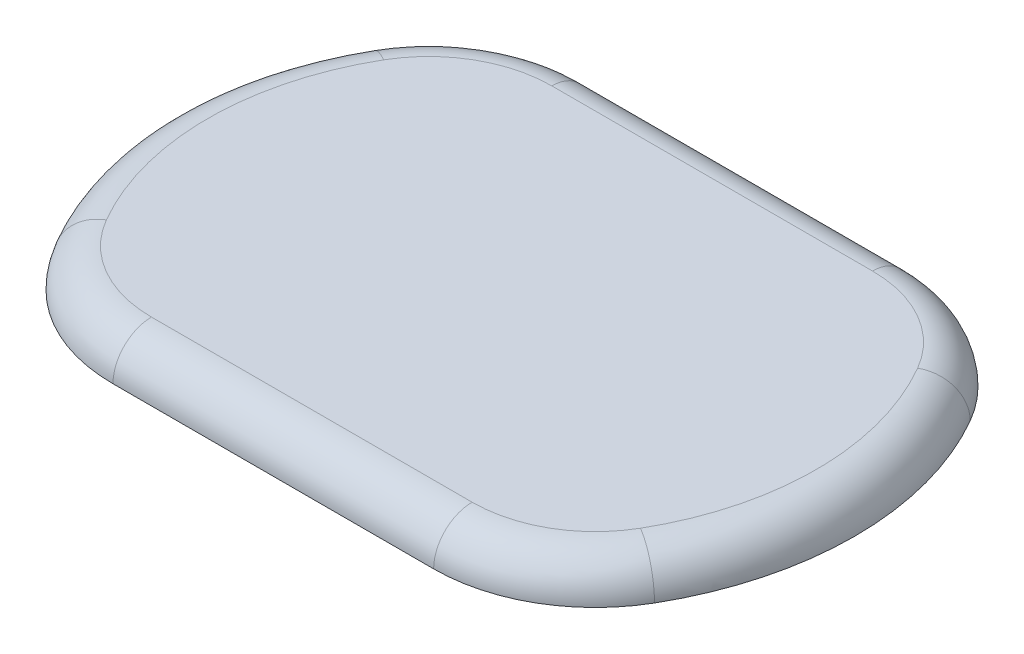
ISO-10303-21;
HEADER;
FILE_DESCRIPTION(('STEP AP214'),'2;1');
FILE_NAME('part.step','',(''),(''),'','','');
FILE_SCHEMA(('AUTOMOTIVE_DESIGN { 1 0 10303 214 1 1 1 1 }'));
ENDSEC;
DATA;
#1=APPLICATION_CONTEXT('core data for automotive mechanical design processes');
#2=APPLICATION_PROTOCOL_DEFINITION('international standard','automotive_design',2000,#1);
#3=PRODUCT_CONTEXT('',#1,'mechanical');
#4=PRODUCT('Part','Part','',(#3));
#5=PRODUCT_RELATED_PRODUCT_CATEGORY('part','',(#4));
#6=PRODUCT_DEFINITION_FORMATION('','',#4);
#7=PRODUCT_DEFINITION_CONTEXT('part definition',#1,'design');
#8=PRODUCT_DEFINITION('design','',#6,#7);
#9=PRODUCT_DEFINITION_SHAPE('','',#8);
#10=(LENGTH_UNIT() NAMED_UNIT(*) SI_UNIT(.MILLI.,.METRE.));
#11=(NAMED_UNIT(*) PLANE_ANGLE_UNIT() SI_UNIT($,.RADIAN.));
#12=(NAMED_UNIT(*) SI_UNIT($,.STERADIAN.) SOLID_ANGLE_UNIT());
#13=UNCERTAINTY_MEASURE_WITH_UNIT(LENGTH_MEASURE(1.E-05),#10,'distance_accuracy_value','');
#14=(GEOMETRIC_REPRESENTATION_CONTEXT(3) GLOBAL_UNCERTAINTY_ASSIGNED_CONTEXT((#13)) GLOBAL_UNIT_ASSIGNED_CONTEXT((#10,
#11,#12)) REPRESENTATION_CONTEXT('',''));
#15=CARTESIAN_POINT('',(0.,0.,0.));
#16=DIRECTION('',(0.,0.,1.));
#17=DIRECTION('',(1.,0.,0.));
#18=AXIS2_PLACEMENT_3D('',#15,#16,#17);
#19=CARTESIAN_POINT('',(0.,5.,0.));
#20=DIRECTION('',(0.,-1.,0.));
#21=DIRECTION('',(0.,0.,-1.));
#22=AXIS2_PLACEMENT_3D('',#19,#20,#21);
#23=PLANE('',#22);
#24=CARTESIAN_POINT('',(13.1205080756888,5.,20.2888888888889));
#25=DIRECTION('',(0.,-1.,0.));
#26=DIRECTION('',(0.,0.,-1.));
#27=AXIS2_PLACEMENT_3D('',#24,#25,#26);
#28=CIRCLE('',#27,16.);
#29=CARTESIAN_POINT('',(13.1205080756888,5.,36.2888888888889));
#30=VERTEX_POINT('',#29);
#31=CARTESIAN_POINT('',(26.9769145362398,5.,28.2888888888889));
#32=VERTEX_POINT('',#31);
#33=EDGE_CURVE('E49',#30,#32,#28,.F.);
#34=ORIENTED_EDGE('',*,*,#33,.T.);
#35=CARTESIAN_POINT('',(-4.20000000000001,5.,10.2888888888889));
#36=DIRECTION('',(0.,-1.,0.));
#37=DIRECTION('',(0.,0.,-1.));
#38=AXIS2_PLACEMENT_3D('',#35,#36,#37);
#39=CIRCLE('',#38,36.);
#40=CARTESIAN_POINT('',(26.9769145362398,5.,-7.71111111111112));
#41=VERTEX_POINT('',#40);
#42=EDGE_CURVE('E11',#32,#41,#39,.F.);
#43=ORIENTED_EDGE('',*,*,#42,.T.);
#44=CARTESIAN_POINT('',(13.1205080756888,5.,0.288888888888884));
#45=DIRECTION('',(0.,-1.,0.));
#46=DIRECTION('',(0.,0.,-1.));
#47=AXIS2_PLACEMENT_3D('',#44,#45,#46);
#48=CIRCLE('',#47,16.);
#49=CARTESIAN_POINT('',(13.1205080756888,5.,-15.7111111111111));
#50=VERTEX_POINT('',#49);
#51=EDGE_CURVE('E117',#41,#50,#48,.F.);
#52=ORIENTED_EDGE('',*,*,#51,.T.);
#53=DIRECTION('',(-1.,0.,0.));
#54=VECTOR('',#53,1.);
#55=CARTESIAN_POINT('',(0.,5.,-15.7111111111111));
#56=LINE('',#55,#54);
#57=CARTESIAN_POINT('',(-28.5205080756888,5.,-15.7111111111111));
#58=VERTEX_POINT('',#57);
#59=EDGE_CURVE('E124',#50,#58,#56,.T.);
#60=ORIENTED_EDGE('',*,*,#59,.T.);
#61=CARTESIAN_POINT('',(-28.5205080756888,5.,0.288888888888884));
#62=DIRECTION('',(0.,-1.,0.));
#63=DIRECTION('',(0.,0.,-1.));
#64=AXIS2_PLACEMENT_3D('',#61,#62,#63);
#65=CIRCLE('',#64,16.);
#66=CARTESIAN_POINT('',(-42.3769145362398,5.,-7.71111111111113));
#67=VERTEX_POINT('',#66);
#68=EDGE_CURVE('E164',#58,#67,#65,.F.);
#69=ORIENTED_EDGE('',*,*,#68,.T.);
#70=CARTESIAN_POINT('',(-11.2,5.,10.2888888888889));
#71=DIRECTION('',(0.,-1.,0.));
#72=DIRECTION('',(0.,0.,-1.));
#73=AXIS2_PLACEMENT_3D('',#70,#71,#72);
#74=CIRCLE('',#73,36.);
#75=CARTESIAN_POINT('',(-42.3769145362398,5.,28.2888888888889));
#76=VERTEX_POINT('',#75);
#77=EDGE_CURVE('E167',#67,#76,#74,.F.);
#78=ORIENTED_EDGE('',*,*,#77,.T.);
#79=CARTESIAN_POINT('',(-28.5205080756888,5.,20.2888888888889));
#80=DIRECTION('',(0.,-1.,0.));
#81=DIRECTION('',(0.,0.,-1.));
#82=AXIS2_PLACEMENT_3D('',#79,#80,#81);
#83=CIRCLE('',#82,16.);
#84=CARTESIAN_POINT('',(-28.5205080756888,5.,36.2888888888889));
#85=VERTEX_POINT('',#84);
#86=EDGE_CURVE('E170',#76,#85,#83,.F.);
#87=ORIENTED_EDGE('',*,*,#86,.T.);
#88=DIRECTION('',(1.,0.,0.));
#89=VECTOR('',#88,1.);
#90=CARTESIAN_POINT('',(0.,5.,36.2888888888889));
#91=LINE('',#90,#89);
#92=EDGE_CURVE('E60',#85,#30,#91,.T.);
#93=ORIENTED_EDGE('',*,*,#92,.T.);
#94=EDGE_LOOP('',(#34,#43,#52,#60,#69,#78,#87,#93));
#95=FACE_BOUND('',#94,.T.);
#96=ADVANCED_FACE('F39',(#95),#23,.F.);
#97=CARTESIAN_POINT('',(0.,0.,0.));
#98=DIRECTION('',(0.,-1.,0.));
#99=DIRECTION('',(0.,0.,-1.));
#100=AXIS2_PLACEMENT_3D('',#97,#98,#99);
#101=PLANE('',#100);
#102=DIRECTION('',(-1.,0.,0.));
#103=VECTOR('',#102,1.);
#104=CARTESIAN_POINT('',(-52.2,0.,-20.7111111111111));
#105=LINE('',#104,#103);
#106=CARTESIAN_POINT('',(13.1205080756888,0.,-20.7111111111111));
#107=VERTEX_POINT('',#106);
#108=CARTESIAN_POINT('',(-28.5205080756888,0.,-20.7111111111111));
#109=VERTEX_POINT('',#108);
#110=EDGE_CURVE('E104',#107,#109,#105,.T.);
#111=ORIENTED_EDGE('',*,*,#110,.F.);
#112=CARTESIAN_POINT('',(13.1205080756888,0.,0.288888888888884));
#113=DIRECTION('',(0.,-1.,0.));
#114=DIRECTION('',(0.,0.,-1.));
#115=AXIS2_PLACEMENT_3D('',#112,#113,#114);
#116=CIRCLE('',#115,21.);
#117=CARTESIAN_POINT('',(31.307041555162,0.,-10.2111111111111));
#118=VERTEX_POINT('',#117);
#119=EDGE_CURVE('E109',#118,#107,#116,.F.);
#120=ORIENTED_EDGE('',*,*,#119,.F.);
#121=CARTESIAN_POINT('',(-4.20000000000001,0.,10.2888888888889));
#122=DIRECTION('',(0.,-1.,0.));
#123=DIRECTION('',(0.,0.,-1.));
#124=AXIS2_PLACEMENT_3D('',#121,#122,#123);
#125=CIRCLE('',#124,41.);
#126=CARTESIAN_POINT('',(31.307041555162,0.,30.7888888888889));
#127=VERTEX_POINT('',#126);
#128=EDGE_CURVE('E148',#127,#118,#125,.F.);
#129=ORIENTED_EDGE('',*,*,#128,.F.);
#130=CARTESIAN_POINT('',(13.1205080756888,0.,20.2888888888889));
#131=DIRECTION('',(0.,-1.,0.));
#132=DIRECTION('',(0.,0.,-1.));
#133=AXIS2_PLACEMENT_3D('',#130,#131,#132);
#134=CIRCLE('',#133,21.);
#135=CARTESIAN_POINT('',(13.1205080756888,0.,41.2888888888889));
#136=VERTEX_POINT('',#135);
#137=EDGE_CURVE('E144',#136,#127,#134,.F.);
#138=ORIENTED_EDGE('',*,*,#137,.F.);
#139=DIRECTION('',(1.,0.,0.));
#140=VECTOR('',#139,1.);
#141=CARTESIAN_POINT('',(36.8,0.,41.2888888888889));
#142=LINE('',#141,#140);
#143=CARTESIAN_POINT('',(-28.5205080756888,0.,41.2888888888889));
#144=VERTEX_POINT('',#143);
#145=EDGE_CURVE('E118',#144,#136,#142,.T.);
#146=ORIENTED_EDGE('',*,*,#145,.F.);
#147=CARTESIAN_POINT('',(-28.5205080756888,0.,20.2888888888889));
#148=DIRECTION('',(0.,-1.,0.));
#149=DIRECTION('',(0.,0.,-1.));
#150=AXIS2_PLACEMENT_3D('',#147,#148,#149);
#151=CIRCLE('',#150,21.);
#152=CARTESIAN_POINT('',(-46.707041555162,0.,30.7888888888889));
#153=VERTEX_POINT('',#152);
#154=EDGE_CURVE('E135',#153,#144,#151,.F.);
#155=ORIENTED_EDGE('',*,*,#154,.F.);
#156=CARTESIAN_POINT('',(-11.2,0.,10.2888888888889));
#157=DIRECTION('',(0.,-1.,0.));
#158=DIRECTION('',(0.,0.,-1.));
#159=AXIS2_PLACEMENT_3D('',#156,#157,#158);
#160=CIRCLE('',#159,41.);
#161=CARTESIAN_POINT('',(-46.707041555162,0.,-10.2111111111111));
#162=VERTEX_POINT('',#161);
#163=EDGE_CURVE('E149',#162,#153,#160,.F.);
#164=ORIENTED_EDGE('',*,*,#163,.F.);
#165=CARTESIAN_POINT('',(-28.5205080756888,0.,0.288888888888884));
#166=DIRECTION('',(0.,-1.,0.));
#167=DIRECTION('',(0.,0.,-1.));
#168=AXIS2_PLACEMENT_3D('',#165,#166,#167);
#169=CIRCLE('',#168,21.);
#170=EDGE_CURVE('E112',#109,#162,#169,.F.);
#171=ORIENTED_EDGE('',*,*,#170,.F.);
#172=EDGE_LOOP('',(#111,#120,#129,#138,#146,#155,#164,#171));
#173=FACE_BOUND('',#172,.T.);
#174=ADVANCED_FACE('F106',(#173),#101,.T.);
#175=CARTESIAN_POINT('',(-11.2,0.,10.2888888888889));
#176=DIRECTION('',(0.,-1.,0.));
#177=DIRECTION('',(0.,0.,-1.));
#178=AXIS2_PLACEMENT_3D('',#175,#176,#177);
#179=TOROIDAL_SURFACE('',#178,36.,5.);
#180=CARTESIAN_POINT('',(-42.3769145362398,0.,-7.71111111111113));
#181=DIRECTION('',(0.5,0.,-0.866025403784438));
#182=DIRECTION('',(-0.866025403784438,0.,-0.5));
#183=AXIS2_PLACEMENT_3D('',#180,#181,#182);
#184=CIRCLE('',#183,5.);
#185=EDGE_CURVE('E142',#162,#67,#184,.T.);
#186=ORIENTED_EDGE('',*,*,#185,.F.);
#187=ORIENTED_EDGE('',*,*,#163,.T.);
#188=CARTESIAN_POINT('',(-42.3769145362398,0.,28.2888888888889));
#189=DIRECTION('',(0.5,0.,0.866025403784439));
#190=DIRECTION('',(0.866025403784439,0.,-0.5));
#191=AXIS2_PLACEMENT_3D('',#188,#189,#190);
#192=CIRCLE('',#191,5.);
#193=EDGE_CURVE('E43',#76,#153,#192,.T.);
#194=ORIENTED_EDGE('',*,*,#193,.F.);
#195=ORIENTED_EDGE('',*,*,#77,.F.);
#196=EDGE_LOOP('',(#186,#187,#194,#195));
#197=FACE_BOUND('',#196,.T.);
#198=ADVANCED_FACE('F41',(#197),#179,.T.);
#199=CARTESIAN_POINT('',(-28.5205080756888,0.,20.2888888888889));
#200=DIRECTION('',(0.,-1.,0.));
#201=DIRECTION('',(0.,0.,-1.));
#202=AXIS2_PLACEMENT_3D('',#199,#200,#201);
#203=TOROIDAL_SURFACE('',#202,16.,5.);
#204=ORIENTED_EDGE('',*,*,#193,.T.);
#205=ORIENTED_EDGE('',*,*,#154,.T.);
#206=CARTESIAN_POINT('',(-28.5205080756888,0.,36.2888888888889));
#207=DIRECTION('',(1.,0.,0.));
#208=DIRECTION('',(0.,0.,-1.));
#209=AXIS2_PLACEMENT_3D('',#206,#207,#208);
#210=CIRCLE('',#209,5.);
#211=EDGE_CURVE('E187',#85,#144,#210,.T.);
#212=ORIENTED_EDGE('',*,*,#211,.F.);
#213=ORIENTED_EDGE('',*,*,#86,.F.);
#214=EDGE_LOOP('',(#204,#205,#212,#213));
#215=FACE_BOUND('',#214,.T.);
#216=ADVANCED_FACE('F257',(#215),#203,.T.);
#217=CARTESIAN_POINT('',(-28.5205080756888,0.,0.288888888888884));
#218=DIRECTION('',(0.,-1.,0.));
#219=DIRECTION('',(0.,0.,-1.));
#220=AXIS2_PLACEMENT_3D('',#217,#218,#219);
#221=TOROIDAL_SURFACE('',#220,16.,5.);
#222=ORIENTED_EDGE('',*,*,#185,.T.);
#223=ORIENTED_EDGE('',*,*,#68,.F.);
#224=CARTESIAN_POINT('',(-28.5205080756888,0.,-15.7111111111111));
#225=DIRECTION('',(1.,0.,0.));
#226=DIRECTION('',(0.,0.,-1.));
#227=AXIS2_PLACEMENT_3D('',#224,#225,#226);
#228=CIRCLE('',#227,5.);
#229=EDGE_CURVE('E184',#109,#58,#228,.T.);
#230=ORIENTED_EDGE('',*,*,#229,.F.);
#231=ORIENTED_EDGE('',*,*,#170,.T.);
#232=EDGE_LOOP('',(#222,#223,#230,#231));
#233=FACE_BOUND('',#232,.T.);
#234=ADVANCED_FACE('F195',(#233),#221,.T.);
#235=CARTESIAN_POINT('',(0.,0.,36.2888888888889));
#236=DIRECTION('',(1.,0.,0.));
#237=DIRECTION('',(0.,0.,-1.));
#238=AXIS2_PLACEMENT_3D('',#235,#236,#237);
#239=CYLINDRICAL_SURFACE('',#238,5.);
#240=ORIENTED_EDGE('',*,*,#211,.T.);
#241=ORIENTED_EDGE('',*,*,#145,.T.);
#242=CARTESIAN_POINT('',(13.1205080756888,0.,36.2888888888889));
#243=DIRECTION('',(1.,0.,0.));
#244=DIRECTION('',(0.,0.,-1.));
#245=AXIS2_PLACEMENT_3D('',#242,#243,#244);
#246=CIRCLE('',#245,5.);
#247=EDGE_CURVE('E128',#30,#136,#246,.T.);
#248=ORIENTED_EDGE('',*,*,#247,.F.);
#249=ORIENTED_EDGE('',*,*,#92,.F.);
#250=EDGE_LOOP('',(#240,#241,#248,#249));
#251=FACE_BOUND('',#250,.T.);
#252=ADVANCED_FACE('F206',(#251),#239,.T.);
#253=CARTESIAN_POINT('',(0.,0.,-15.7111111111111));
#254=DIRECTION('',(-1.,0.,0.));
#255=DIRECTION('',(0.,0.,1.));
#256=AXIS2_PLACEMENT_3D('',#253,#254,#255);
#257=CYLINDRICAL_SURFACE('',#256,5.);
#258=ORIENTED_EDGE('',*,*,#229,.T.);
#259=ORIENTED_EDGE('',*,*,#59,.F.);
#260=CARTESIAN_POINT('',(13.1205080756888,0.,-15.7111111111111));
#261=DIRECTION('',(1.,0.,0.));
#262=DIRECTION('',(0.,0.,-1.));
#263=AXIS2_PLACEMENT_3D('',#260,#261,#262);
#264=CIRCLE('',#263,5.);
#265=EDGE_CURVE('E122',#107,#50,#264,.T.);
#266=ORIENTED_EDGE('',*,*,#265,.F.);
#267=ORIENTED_EDGE('',*,*,#110,.T.);
#268=EDGE_LOOP('',(#258,#259,#266,#267));
#269=FACE_BOUND('',#268,.T.);
#270=ADVANCED_FACE('F123',(#269),#257,.T.);
#271=CARTESIAN_POINT('',(13.1205080756888,0.,20.2888888888889));
#272=DIRECTION('',(0.,-1.,0.));
#273=DIRECTION('',(0.,0.,-1.));
#274=AXIS2_PLACEMENT_3D('',#271,#272,#273);
#275=TOROIDAL_SURFACE('',#274,16.,5.);
#276=ORIENTED_EDGE('',*,*,#247,.T.);
#277=ORIENTED_EDGE('',*,*,#137,.T.);
#278=CARTESIAN_POINT('',(26.9769145362398,0.,28.2888888888889));
#279=DIRECTION('',(0.500000000000001,0.,-0.866025403784438));
#280=DIRECTION('',(-0.866025403784438,0.,-0.500000000000001));
#281=AXIS2_PLACEMENT_3D('',#278,#279,#280);
#282=CIRCLE('',#281,5.);
#283=EDGE_CURVE('E129',#32,#127,#282,.T.);
#284=ORIENTED_EDGE('',*,*,#283,.F.);
#285=ORIENTED_EDGE('',*,*,#33,.F.);
#286=EDGE_LOOP('',(#276,#277,#284,#285));
#287=FACE_BOUND('',#286,.T.);
#288=ADVANCED_FACE('F207',(#287),#275,.T.);
#289=CARTESIAN_POINT('',(13.1205080756888,0.,0.288888888888884));
#290=DIRECTION('',(0.,-1.,0.));
#291=DIRECTION('',(0.,0.,-1.));
#292=AXIS2_PLACEMENT_3D('',#289,#290,#291);
#293=TOROIDAL_SURFACE('',#292,16.,5.);
#294=ORIENTED_EDGE('',*,*,#265,.T.);
#295=ORIENTED_EDGE('',*,*,#51,.F.);
#296=CARTESIAN_POINT('',(26.9769145362398,0.,-7.71111111111112));
#297=DIRECTION('',(0.5,0.,0.866025403784439));
#298=DIRECTION('',(0.866025403784439,0.,-0.5));
#299=AXIS2_PLACEMENT_3D('',#296,#297,#298);
#300=CIRCLE('',#299,5.);
#301=EDGE_CURVE('E133',#118,#41,#300,.T.);
#302=ORIENTED_EDGE('',*,*,#301,.F.);
#303=ORIENTED_EDGE('',*,*,#119,.T.);
#304=EDGE_LOOP('',(#294,#295,#302,#303));
#305=FACE_BOUND('',#304,.T.);
#306=ADVANCED_FACE('F132',(#305),#293,.T.);
#307=CARTESIAN_POINT('',(-4.20000000000001,0.,10.2888888888889));
#308=DIRECTION('',(0.,-1.,0.));
#309=DIRECTION('',(0.,0.,-1.));
#310=AXIS2_PLACEMENT_3D('',#307,#308,#309);
#311=TOROIDAL_SURFACE('',#310,36.,5.);
#312=ORIENTED_EDGE('',*,*,#283,.T.);
#313=ORIENTED_EDGE('',*,*,#128,.T.);
#314=ORIENTED_EDGE('',*,*,#301,.T.);
#315=ORIENTED_EDGE('',*,*,#42,.F.);
#316=EDGE_LOOP('',(#312,#313,#314,#315));
#317=FACE_BOUND('',#316,.T.);
#318=ADVANCED_FACE('F203',(#317),#311,.T.);
#319=CLOSED_SHELL('',(#96,#174,#198,#216,#234,#252,#270,#288,#306,#318));
#320=MANIFOLD_SOLID_BREP('B2',#319);
#321=ADVANCED_BREP_SHAPE_REPRESENTATION('',(#18,#320),#14);
#322=SHAPE_DEFINITION_REPRESENTATION(#9,#321);
ENDSEC;
END-ISO-10303-21;
